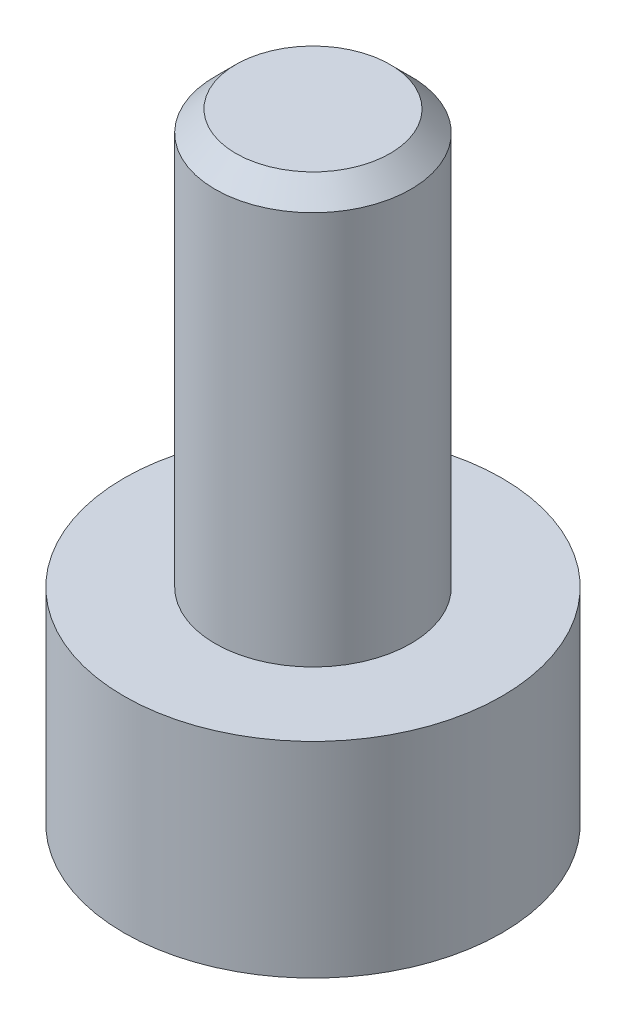
ISO-10303-21;
HEADER;
FILE_DESCRIPTION(('STEP AP214'),'2;1');
FILE_NAME('part.step','',(''),(''),'','','');
FILE_SCHEMA(('AUTOMOTIVE_DESIGN { 1 0 10303 214 1 1 1 1 }'));
ENDSEC;
DATA;
#1=APPLICATION_CONTEXT('core data for automotive mechanical design processes');
#2=APPLICATION_PROTOCOL_DEFINITION('international standard','automotive_design',2000,#1);
#3=PRODUCT_CONTEXT('',#1,'mechanical');
#4=PRODUCT('Part','Part','',(#3));
#5=PRODUCT_RELATED_PRODUCT_CATEGORY('part','',(#4));
#6=PRODUCT_DEFINITION_FORMATION('','',#4);
#7=PRODUCT_DEFINITION_CONTEXT('part definition',#1,'design');
#8=PRODUCT_DEFINITION('design','',#6,#7);
#9=PRODUCT_DEFINITION_SHAPE('','',#8);
#10=(LENGTH_UNIT() NAMED_UNIT(*) SI_UNIT(.MILLI.,.METRE.));
#11=(NAMED_UNIT(*) PLANE_ANGLE_UNIT() SI_UNIT($,.RADIAN.));
#12=(NAMED_UNIT(*) SI_UNIT($,.STERADIAN.) SOLID_ANGLE_UNIT());
#13=UNCERTAINTY_MEASURE_WITH_UNIT(LENGTH_MEASURE(1.E-05),#10,'distance_accuracy_value','');
#14=(GEOMETRIC_REPRESENTATION_CONTEXT(3) GLOBAL_UNCERTAINTY_ASSIGNED_CONTEXT((#13)) GLOBAL_UNIT_ASSIGNED_CONTEXT((#10,
#11,#12)) REPRESENTATION_CONTEXT('',''));
#15=CARTESIAN_POINT('',(0.,0.,0.));
#16=DIRECTION('',(0.,0.,1.));
#17=DIRECTION('',(1.,0.,0.));
#18=AXIS2_PLACEMENT_3D('',#15,#16,#17);
#19=CARTESIAN_POINT('',(0.,1.98,0.));
#20=DIRECTION('',(0.,-1.,0.));
#21=DIRECTION('',(0.,0.,-1.));
#22=AXIS2_PLACEMENT_3D('',#19,#20,#21);
#23=CYLINDRICAL_SURFACE('',#22,1.825);
#24=CARTESIAN_POINT('',(0.,1.98,0.));
#25=DIRECTION('',(0.,1.,0.));
#26=DIRECTION('',(0.,0.,1.));
#27=AXIS2_PLACEMENT_3D('',#24,#25,#26);
#28=CIRCLE('',#27,1.825);
#29=CARTESIAN_POINT('',(0.,1.98,1.825));
#30=VERTEX_POINT('',#29);
#31=EDGE_CURVE('E177',#30,#30,#28,.T.);
#32=ORIENTED_EDGE('',*,*,#31,.F.);
#33=EDGE_LOOP('',(#32));
#34=FACE_BOUND('',#33,.T.);
#35=CARTESIAN_POINT('',(0.,0.,0.));
#36=DIRECTION('',(0.,1.,0.));
#37=DIRECTION('',(0.,0.,1.));
#38=AXIS2_PLACEMENT_3D('',#35,#36,#37);
#39=CIRCLE('',#38,1.825);
#40=CARTESIAN_POINT('',(0.,0.,1.825));
#41=VERTEX_POINT('',#40);
#42=EDGE_CURVE('E163',#41,#41,#39,.T.);
#43=ORIENTED_EDGE('',*,*,#42,.T.);
#44=EDGE_LOOP('',(#43));
#45=FACE_BOUND('',#44,.T.);
#46=ADVANCED_FACE('F47',(#34,#45),#23,.T.);
#47=CARTESIAN_POINT('',(0.,1.98,0.));
#48=DIRECTION('',(0.,1.,0.));
#49=DIRECTION('',(0.,0.,1.));
#50=AXIS2_PLACEMENT_3D('',#47,#48,#49);
#51=PLANE('',#50);
#52=CARTESIAN_POINT('',(0.,1.98,0.));
#53=DIRECTION('',(0.,1.,0.));
#54=DIRECTION('',(0.,0.,1.));
#55=AXIS2_PLACEMENT_3D('',#52,#53,#54);
#56=CIRCLE('',#55,0.945);
#57=CARTESIAN_POINT('',(0.,1.98,0.945));
#58=VERTEX_POINT('',#57);
#59=EDGE_CURVE('E173',#58,#58,#56,.T.);
#60=ORIENTED_EDGE('',*,*,#59,.F.);
#61=EDGE_LOOP('',(#60));
#62=FACE_BOUND('',#61,.T.);
#63=ORIENTED_EDGE('',*,*,#31,.T.);
#64=EDGE_LOOP('',(#63));
#65=FACE_BOUND('',#64,.T.);
#66=ADVANCED_FACE('F199',(#62,#65),#51,.T.);
#67=CARTESIAN_POINT('',(0.,0.,0.));
#68=DIRECTION('',(0.,1.,0.));
#69=DIRECTION('',(0.,0.,1.));
#70=AXIS2_PLACEMENT_3D('',#67,#68,#69);
#71=PLANE('',#70);
#72=DIRECTION('',(0.5,0.,0.866025403784439));
#73=VECTOR('',#72,1.);
#74=CARTESIAN_POINT('',(0.458993464005752,0.,-0.795));
#75=LINE('',#74,#73);
#76=CARTESIAN_POINT('',(0.458993464005752,0.,-0.795));
#77=VERTEX_POINT('',#76);
#78=CARTESIAN_POINT('',(0.917986928011505,0.,0.));
#79=VERTEX_POINT('',#78);
#80=EDGE_CURVE('E144',#77,#79,#75,.T.);
#81=ORIENTED_EDGE('',*,*,#80,.F.);
#82=DIRECTION('',(1.,0.,0.));
#83=VECTOR('',#82,1.);
#84=CARTESIAN_POINT('',(-0.458993464005752,0.,-0.795));
#85=LINE('',#84,#83);
#86=CARTESIAN_POINT('',(-0.458993464005752,0.,-0.795));
#87=VERTEX_POINT('',#86);
#88=EDGE_CURVE('E64',#87,#77,#85,.T.);
#89=ORIENTED_EDGE('',*,*,#88,.F.);
#90=DIRECTION('',(0.5,0.,-0.866025403784439));
#91=VECTOR('',#90,1.);
#92=CARTESIAN_POINT('',(-0.917986928011505,0.,0.));
#93=LINE('',#92,#91);
#94=CARTESIAN_POINT('',(-0.917986928011505,0.,0.));
#95=VERTEX_POINT('',#94);
#96=EDGE_CURVE('E157',#95,#87,#93,.T.);
#97=ORIENTED_EDGE('',*,*,#96,.F.);
#98=DIRECTION('',(-0.5,0.,-0.866025403784439));
#99=VECTOR('',#98,1.);
#100=CARTESIAN_POINT('',(-0.458993464005753,0.,0.795));
#101=LINE('',#100,#99);
#102=CARTESIAN_POINT('',(-0.458993464005753,0.,0.795));
#103=VERTEX_POINT('',#102);
#104=EDGE_CURVE('E154',#103,#95,#101,.T.);
#105=ORIENTED_EDGE('',*,*,#104,.F.);
#106=DIRECTION('',(-1.,0.,0.));
#107=VECTOR('',#106,1.);
#108=CARTESIAN_POINT('',(0.458993464005752,0.,0.795));
#109=LINE('',#108,#107);
#110=CARTESIAN_POINT('',(0.458993464005752,0.,0.795));
#111=VERTEX_POINT('',#110);
#112=EDGE_CURVE('E112',#111,#103,#109,.T.);
#113=ORIENTED_EDGE('',*,*,#112,.F.);
#114=DIRECTION('',(-0.5,0.,0.866025403784438));
#115=VECTOR('',#114,1.);
#116=CARTESIAN_POINT('',(0.917986928011505,0.,0.));
#117=LINE('',#116,#115);
#118=EDGE_CURVE('E148',#79,#111,#117,.T.);
#119=ORIENTED_EDGE('',*,*,#118,.F.);
#120=EDGE_LOOP('',(#81,#89,#97,#105,#113,#119));
#121=FACE_BOUND('',#120,.T.);
#122=ORIENTED_EDGE('',*,*,#42,.F.);
#123=EDGE_LOOP('',(#122));
#124=FACE_BOUND('',#123,.T.);
#125=ADVANCED_FACE('F204',(#121,#124),#71,.F.);
#126=CARTESIAN_POINT('',(0.,5.98,0.));
#127=DIRECTION('',(0.,-1.,0.));
#128=DIRECTION('',(0.,0.,-1.));
#129=AXIS2_PLACEMENT_3D('',#126,#127,#128);
#130=CYLINDRICAL_SURFACE('',#129,0.945);
#131=CARTESIAN_POINT('',(0.,5.78,0.));
#132=DIRECTION('',(0.,1.,0.));
#133=DIRECTION('',(0.,0.,1.));
#134=AXIS2_PLACEMENT_3D('',#131,#132,#133);
#135=CIRCLE('',#134,0.945);
#136=CARTESIAN_POINT('',(0.,5.78,0.945));
#137=VERTEX_POINT('',#136);
#138=EDGE_CURVE('E11',#137,#137,#135,.F.);
#139=ORIENTED_EDGE('',*,*,#138,.T.);
#140=EDGE_LOOP('',(#139));
#141=FACE_BOUND('',#140,.T.);
#142=ORIENTED_EDGE('',*,*,#59,.T.);
#143=EDGE_LOOP('',(#142));
#144=FACE_BOUND('',#143,.T.);
#145=ADVANCED_FACE('F211',(#141,#144),#130,.T.);
#146=CARTESIAN_POINT('',(0.,5.98,0.));
#147=DIRECTION('',(0.,1.,0.));
#148=DIRECTION('',(0.,0.,1.));
#149=AXIS2_PLACEMENT_3D('',#146,#147,#148);
#150=PLANE('',#149);
#151=CARTESIAN_POINT('',(0.,5.98,0.));
#152=DIRECTION('',(0.,1.,0.));
#153=DIRECTION('',(0.,0.,1.));
#154=AXIS2_PLACEMENT_3D('',#151,#152,#153);
#155=CIRCLE('',#154,0.745000000000001);
#156=CARTESIAN_POINT('',(0.,5.98,0.745000000000001));
#157=VERTEX_POINT('',#156);
#158=EDGE_CURVE('E57',#157,#157,#155,.T.);
#159=ORIENTED_EDGE('',*,*,#158,.T.);
#160=EDGE_LOOP('',(#159));
#161=FACE_BOUND('',#160,.T.);
#162=ADVANCED_FACE('F187',(#161),#150,.T.);
#163=CARTESIAN_POINT('',(-0.458993464005752,1.,-0.795));
#164=DIRECTION('',(0.,0.,-1.));
#165=DIRECTION('',(-1.,0.,0.));
#166=AXIS2_PLACEMENT_3D('',#163,#164,#165);
#167=PLANE('',#166);
#168=ORIENTED_EDGE('',*,*,#88,.T.);
#169=DIRECTION('',(0.,-1.,0.));
#170=VECTOR('',#169,1.);
#171=CARTESIAN_POINT('',(0.458993464005752,1.,-0.795));
#172=LINE('',#171,#170);
#173=CARTESIAN_POINT('',(0.458993464005752,1.,-0.795));
#174=VERTEX_POINT('',#173);
#175=EDGE_CURVE('E94',#174,#77,#172,.T.);
#176=ORIENTED_EDGE('',*,*,#175,.F.);
#177=DIRECTION('',(1.,0.,0.));
#178=VECTOR('',#177,1.);
#179=CARTESIAN_POINT('',(-0.458993464005752,1.,-0.795));
#180=LINE('',#179,#178);
#181=CARTESIAN_POINT('',(-0.458993464005752,1.,-0.795));
#182=VERTEX_POINT('',#181);
#183=EDGE_CURVE('E160',#182,#174,#180,.T.);
#184=ORIENTED_EDGE('',*,*,#183,.F.);
#185=DIRECTION('',(0.,-1.,0.));
#186=VECTOR('',#185,1.);
#187=CARTESIAN_POINT('',(-0.458993464005752,1.,-0.795));
#188=LINE('',#187,#186);
#189=EDGE_CURVE('E72',#182,#87,#188,.T.);
#190=ORIENTED_EDGE('',*,*,#189,.T.);
#191=EDGE_LOOP('',(#168,#176,#184,#190));
#192=FACE_BOUND('',#191,.T.);
#193=ADVANCED_FACE('F218',(#192),#167,.F.);
#194=CARTESIAN_POINT('',(-0.917986928011505,1.,0.));
#195=DIRECTION('',(-0.866025403784439,0.,-0.5));
#196=DIRECTION('',(-0.5,0.,0.866025403784439));
#197=AXIS2_PLACEMENT_3D('',#194,#195,#196);
#198=PLANE('',#197);
#199=ORIENTED_EDGE('',*,*,#96,.T.);
#200=ORIENTED_EDGE('',*,*,#189,.F.);
#201=DIRECTION('',(0.5,0.,-0.866025403784439));
#202=VECTOR('',#201,1.);
#203=CARTESIAN_POINT('',(-0.917986928011505,1.,0.));
#204=LINE('',#203,#202);
#205=CARTESIAN_POINT('',(-0.917986928011505,1.,0.));
#206=VERTEX_POINT('',#205);
#207=EDGE_CURVE('E126',#206,#182,#204,.T.);
#208=ORIENTED_EDGE('',*,*,#207,.F.);
#209=DIRECTION('',(0.,-1.,0.));
#210=VECTOR('',#209,1.);
#211=CARTESIAN_POINT('',(-0.917986928011505,1.,0.));
#212=LINE('',#211,#210);
#213=EDGE_CURVE('E117',#206,#95,#212,.T.);
#214=ORIENTED_EDGE('',*,*,#213,.T.);
#215=EDGE_LOOP('',(#199,#200,#208,#214));
#216=FACE_BOUND('',#215,.T.);
#217=ADVANCED_FACE('F221',(#216),#198,.F.);
#218=CARTESIAN_POINT('',(-0.458993464005753,1.,0.795));
#219=DIRECTION('',(-0.866025403784439,0.,0.5));
#220=DIRECTION('',(0.5,0.,0.866025403784439));
#221=AXIS2_PLACEMENT_3D('',#218,#219,#220);
#222=PLANE('',#221);
#223=ORIENTED_EDGE('',*,*,#104,.T.);
#224=ORIENTED_EDGE('',*,*,#213,.F.);
#225=DIRECTION('',(-0.5,0.,-0.866025403784439));
#226=VECTOR('',#225,1.);
#227=CARTESIAN_POINT('',(-0.458993464005753,1.,0.795));
#228=LINE('',#227,#226);
#229=CARTESIAN_POINT('',(-0.458993464005753,1.,0.795));
#230=VERTEX_POINT('',#229);
#231=EDGE_CURVE('E121',#230,#206,#228,.T.);
#232=ORIENTED_EDGE('',*,*,#231,.F.);
#233=DIRECTION('',(0.,-1.,0.));
#234=VECTOR('',#233,1.);
#235=CARTESIAN_POINT('',(-0.458993464005753,1.,0.795));
#236=LINE('',#235,#234);
#237=EDGE_CURVE('E105',#230,#103,#236,.T.);
#238=ORIENTED_EDGE('',*,*,#237,.T.);
#239=EDGE_LOOP('',(#223,#224,#232,#238));
#240=FACE_BOUND('',#239,.T.);
#241=ADVANCED_FACE('F122',(#240),#222,.F.);
#242=CARTESIAN_POINT('',(0.458993464005752,1.,0.795));
#243=DIRECTION('',(0.,0.,1.));
#244=DIRECTION('',(1.,0.,0.));
#245=AXIS2_PLACEMENT_3D('',#242,#243,#244);
#246=PLANE('',#245);
#247=ORIENTED_EDGE('',*,*,#112,.T.);
#248=ORIENTED_EDGE('',*,*,#237,.F.);
#249=DIRECTION('',(-1.,0.,0.));
#250=VECTOR('',#249,1.);
#251=CARTESIAN_POINT('',(0.458993464005752,1.,0.795));
#252=LINE('',#251,#250);
#253=CARTESIAN_POINT('',(0.458993464005752,1.,0.795));
#254=VERTEX_POINT('',#253);
#255=EDGE_CURVE('E109',#254,#230,#252,.T.);
#256=ORIENTED_EDGE('',*,*,#255,.F.);
#257=DIRECTION('',(0.,-1.,0.));
#258=VECTOR('',#257,1.);
#259=CARTESIAN_POINT('',(0.458993464005752,1.,0.795));
#260=LINE('',#259,#258);
#261=EDGE_CURVE('E118',#254,#111,#260,.T.);
#262=ORIENTED_EDGE('',*,*,#261,.T.);
#263=EDGE_LOOP('',(#247,#248,#256,#262));
#264=FACE_BOUND('',#263,.T.);
#265=ADVANCED_FACE('F107',(#264),#246,.F.);
#266=CARTESIAN_POINT('',(0.917986928011505,1.,0.));
#267=DIRECTION('',(0.866025403784438,0.,0.5));
#268=DIRECTION('',(0.5,0.,-0.866025403784439));
#269=AXIS2_PLACEMENT_3D('',#266,#267,#268);
#270=PLANE('',#269);
#271=ORIENTED_EDGE('',*,*,#118,.T.);
#272=ORIENTED_EDGE('',*,*,#261,.F.);
#273=DIRECTION('',(-0.5,0.,0.866025403784438));
#274=VECTOR('',#273,1.);
#275=CARTESIAN_POINT('',(0.917986928011505,1.,0.));
#276=LINE('',#275,#274);
#277=CARTESIAN_POINT('',(0.917986928011505,1.,0.));
#278=VERTEX_POINT('',#277);
#279=EDGE_CURVE('E132',#278,#254,#276,.T.);
#280=ORIENTED_EDGE('',*,*,#279,.F.);
#281=DIRECTION('',(0.,-1.,0.));
#282=VECTOR('',#281,1.);
#283=CARTESIAN_POINT('',(0.917986928011505,1.,0.));
#284=LINE('',#283,#282);
#285=EDGE_CURVE('E168',#278,#79,#284,.T.);
#286=ORIENTED_EDGE('',*,*,#285,.T.);
#287=EDGE_LOOP('',(#271,#272,#280,#286));
#288=FACE_BOUND('',#287,.T.);
#289=ADVANCED_FACE('F224',(#288),#270,.F.);
#290=CARTESIAN_POINT('',(0.458993464005752,1.,-0.795));
#291=DIRECTION('',(0.866025403784439,0.,-0.5));
#292=DIRECTION('',(-0.5,0.,-0.866025403784439));
#293=AXIS2_PLACEMENT_3D('',#290,#291,#292);
#294=PLANE('',#293);
#295=ORIENTED_EDGE('',*,*,#80,.T.);
#296=ORIENTED_EDGE('',*,*,#285,.F.);
#297=DIRECTION('',(0.5,0.,0.866025403784439));
#298=VECTOR('',#297,1.);
#299=CARTESIAN_POINT('',(0.458993464005752,1.,-0.795));
#300=LINE('',#299,#298);
#301=EDGE_CURVE('E136',#174,#278,#300,.T.);
#302=ORIENTED_EDGE('',*,*,#301,.F.);
#303=ORIENTED_EDGE('',*,*,#175,.T.);
#304=EDGE_LOOP('',(#295,#296,#302,#303));
#305=FACE_BOUND('',#304,.T.);
#306=ADVANCED_FACE('F195',(#305),#294,.F.);
#307=CARTESIAN_POINT('',(0.,1.,0.));
#308=DIRECTION('',(0.,-1.,0.));
#309=DIRECTION('',(0.,0.,-1.));
#310=AXIS2_PLACEMENT_3D('',#307,#308,#309);
#311=PLANE('',#310);
#312=ORIENTED_EDGE('',*,*,#183,.T.);
#313=ORIENTED_EDGE('',*,*,#301,.T.);
#314=ORIENTED_EDGE('',*,*,#279,.T.);
#315=ORIENTED_EDGE('',*,*,#255,.T.);
#316=ORIENTED_EDGE('',*,*,#231,.T.);
#317=ORIENTED_EDGE('',*,*,#207,.T.);
#318=EDGE_LOOP('',(#312,#313,#314,#315,#316,#317));
#319=FACE_BOUND('',#318,.T.);
#320=ADVANCED_FACE('F129',(#319),#311,.T.);
#321=CARTESIAN_POINT('',(0.,5.98,0.));
#322=DIRECTION('',(0.,-1.,0.));
#323=DIRECTION('',(0.,0.,-1.));
#324=AXIS2_PLACEMENT_3D('',#321,#322,#323);
#325=CONICAL_SURFACE('',#324,0.745000000000001,0.785398163397445);
#326=ORIENTED_EDGE('',*,*,#138,.F.);
#327=EDGE_LOOP('',(#326));
#328=FACE_BOUND('',#327,.T.);
#329=ORIENTED_EDGE('',*,*,#158,.F.);
#330=EDGE_LOOP('',(#329));
#331=FACE_BOUND('',#330,.T.);
#332=ADVANCED_FACE('F50',(#328,#331),#325,.T.);
#333=CLOSED_SHELL('',(#46,#66,#125,#145,#162,#193,#217,#241,#265,#289,#306,#320,#332));
#334=MANIFOLD_SOLID_BREP('B2',#333);
#335=ADVANCED_BREP_SHAPE_REPRESENTATION('',(#18,#334),#14);
#336=SHAPE_DEFINITION_REPRESENTATION(#9,#335);
ENDSEC;
END-ISO-10303-21;
